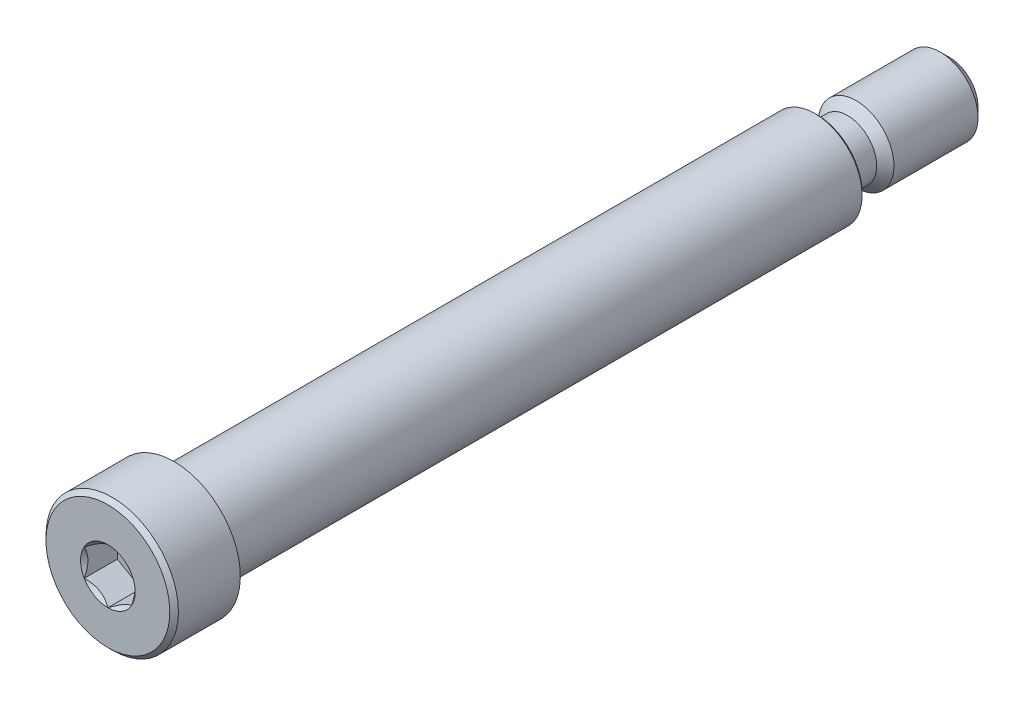
ISO-10303-21;
HEADER;
FILE_DESCRIPTION(('STEP AP214'),'2;1');
FILE_NAME('part.step','',(''),(''),'','','');
FILE_SCHEMA(('AUTOMOTIVE_DESIGN { 1 0 10303 214 1 1 1 1 }'));
ENDSEC;
DATA;
#1=APPLICATION_CONTEXT('core data for automotive mechanical design processes');
#2=APPLICATION_PROTOCOL_DEFINITION('international standard','automotive_design',2000,#1);
#3=PRODUCT_CONTEXT('',#1,'mechanical');
#4=PRODUCT('Part','Part','',(#3));
#5=PRODUCT_RELATED_PRODUCT_CATEGORY('part','',(#4));
#6=PRODUCT_DEFINITION_FORMATION('','',#4);
#7=PRODUCT_DEFINITION_CONTEXT('part definition',#1,'design');
#8=PRODUCT_DEFINITION('design','',#6,#7);
#9=PRODUCT_DEFINITION_SHAPE('','',#8);
#10=(LENGTH_UNIT() NAMED_UNIT(*) SI_UNIT(.MILLI.,.METRE.));
#11=(NAMED_UNIT(*) PLANE_ANGLE_UNIT() SI_UNIT($,.RADIAN.));
#12=(NAMED_UNIT(*) SI_UNIT($,.STERADIAN.) SOLID_ANGLE_UNIT());
#13=UNCERTAINTY_MEASURE_WITH_UNIT(LENGTH_MEASURE(1.E-05),#10,'distance_accuracy_value','');
#14=(GEOMETRIC_REPRESENTATION_CONTEXT(3) GLOBAL_UNCERTAINTY_ASSIGNED_CONTEXT((#13)) GLOBAL_UNIT_ASSIGNED_CONTEXT((#10,
#11,#12)) REPRESENTATION_CONTEXT('',''));
#15=CARTESIAN_POINT('',(0.,0.,0.));
#16=DIRECTION('',(0.,0.,1.));
#17=DIRECTION('',(1.,0.,0.));
#18=AXIS2_PLACEMENT_3D('',#15,#16,#17);
#19=CARTESIAN_POINT('',(0.,0.,0.));
#20=DIRECTION('',(0.,0.,1.));
#21=DIRECTION('',(0.,-1.,0.));
#22=AXIS2_PLACEMENT_3D('',#19,#20,#21);
#23=PLANE('',#22);
#24=CARTESIAN_POINT('',(0.,0.,0.));
#25=DIRECTION('',(0.,0.,1.));
#26=DIRECTION('',(1.,0.,0.));
#27=AXIS2_PLACEMENT_3D('',#24,#25,#26);
#28=CIRCLE('',#27,2.29135888084632);
#29=CARTESIAN_POINT('',(0.,-2.29135888084633,0.));
#30=VERTEX_POINT('',#29);
#31=CARTESIAN_POINT('',(1.98437499999999,-1.14567944042318,0.));
#32=VERTEX_POINT('',#31);
#33=EDGE_CURVE('E62',#30,#32,#28,.T.);
#34=ORIENTED_EDGE('',*,*,#33,.F.);
#35=CARTESIAN_POINT('',(-1.984375,-1.14567944042317,0.));
#36=VERTEX_POINT('',#35);
#37=EDGE_CURVE('E69',#36,#30,#28,.T.);
#38=ORIENTED_EDGE('',*,*,#37,.F.);
#39=CARTESIAN_POINT('',(-1.984375,1.14567944042316,0.));
#40=VERTEX_POINT('',#39);
#41=EDGE_CURVE('E148',#40,#36,#28,.T.);
#42=ORIENTED_EDGE('',*,*,#41,.F.);
#43=CARTESIAN_POINT('',(0.,2.29135888084632,0.));
#44=VERTEX_POINT('',#43);
#45=EDGE_CURVE('E140',#44,#40,#28,.T.);
#46=ORIENTED_EDGE('',*,*,#45,.F.);
#47=CARTESIAN_POINT('',(1.984375,1.14567944042316,0.));
#48=VERTEX_POINT('',#47);
#49=EDGE_CURVE('E111',#48,#44,#28,.T.);
#50=ORIENTED_EDGE('',*,*,#49,.F.);
#51=EDGE_CURVE('E101',#32,#48,#28,.T.);
#52=ORIENTED_EDGE('',*,*,#51,.F.);
#53=EDGE_LOOP('',(#34,#38,#42,#46,#50,#52));
#54=FACE_BOUND('',#53,.T.);
#55=CARTESIAN_POINT('',(0.,0.,0.));
#56=DIRECTION('',(0.,0.,1.));
#57=DIRECTION('',(0.,-1.,0.));
#58=AXIS2_PLACEMENT_3D('',#55,#56,#57);
#59=CIRCLE('',#58,5.19509374999999);
#60=CARTESIAN_POINT('',(0.,-5.19509374999999,0.));
#61=VERTEX_POINT('',#60);
#62=EDGE_CURVE('E234',#61,#61,#59,.T.);
#63=ORIENTED_EDGE('',*,*,#62,.T.);
#64=EDGE_LOOP('',(#63));
#65=FACE_BOUND('',#64,.T.);
#66=ADVANCED_FACE('F41',(#54,#65),#23,.T.);
#67=CARTESIAN_POINT('',(0.,0.,-70.64375));
#68=DIRECTION('',(0.,0.,-1.));
#69=DIRECTION('',(0.,1.,0.));
#70=AXIS2_PLACEMENT_3D('',#67,#68,#69);
#71=CYLINDRICAL_SURFACE('',#70,5.55625);
#72=CARTESIAN_POINT('',(0.,0.,-0.361156249999994));
#73=DIRECTION('',(0.,0.,1.));
#74=DIRECTION('',(0.,-1.,0.));
#75=AXIS2_PLACEMENT_3D('',#72,#73,#74);
#76=CIRCLE('',#75,5.55625);
#77=CARTESIAN_POINT('',(0.,-5.55625,-0.361156249999993));
#78=VERTEX_POINT('',#77);
#79=EDGE_CURVE('E237',#78,#78,#76,.F.);
#80=ORIENTED_EDGE('',*,*,#79,.T.);
#81=EDGE_LOOP('',(#80));
#82=FACE_BOUND('',#81,.T.);
#83=CARTESIAN_POINT('',(0.,0.,-5.55625));
#84=DIRECTION('',(0.,0.,-1.));
#85=DIRECTION('',(0.,1.,0.));
#86=AXIS2_PLACEMENT_3D('',#83,#84,#85);
#87=CIRCLE('',#86,5.55625);
#88=CARTESIAN_POINT('',(0.,5.55624999999999,-5.55625));
#89=VERTEX_POINT('',#88);
#90=EDGE_CURVE('E287',#89,#89,#87,.T.);
#91=ORIENTED_EDGE('',*,*,#90,.F.);
#92=EDGE_LOOP('',(#91));
#93=FACE_BOUND('',#92,.T.);
#94=ADVANCED_FACE('F210',(#82,#93),#71,.T.);
#95=CARTESIAN_POINT('',(0.,-5.55625,-5.55625));
#96=DIRECTION('',(0.,0.,-1.));
#97=DIRECTION('',(0.,1.,0.));
#98=AXIS2_PLACEMENT_3D('',#95,#96,#97);
#99=PLANE('',#98);
#100=ORIENTED_EDGE('',*,*,#90,.T.);
#101=EDGE_LOOP('',(#100));
#102=FACE_BOUND('',#101,.T.);
#103=CARTESIAN_POINT('',(0.,0.,-5.55625));
#104=DIRECTION('',(0.,0.,-1.));
#105=DIRECTION('',(0.,1.,0.));
#106=AXIS2_PLACEMENT_3D('',#103,#104,#105);
#107=CIRCLE('',#106,3.96874999999998);
#108=CARTESIAN_POINT('',(0.,3.96874999999998,-5.55625));
#109=VERTEX_POINT('',#108);
#110=EDGE_CURVE('E277',#109,#109,#107,.T.);
#111=ORIENTED_EDGE('',*,*,#110,.F.);
#112=EDGE_LOOP('',(#111));
#113=FACE_BOUND('',#112,.T.);
#114=ADVANCED_FACE('F215',(#102,#113),#99,.T.);
#115=CARTESIAN_POINT('',(0.,0.,-70.64375));
#116=DIRECTION('',(0.,0.,-1.));
#117=DIRECTION('',(0.,1.,0.));
#118=AXIS2_PLACEMENT_3D('',#115,#116,#117);
#119=CYLINDRICAL_SURFACE('',#118,3.96874999999999);
#120=CARTESIAN_POINT('',(0.,0.,-59.32805));
#121=DIRECTION('',(0.,0.,-1.));
#122=DIRECTION('',(0.,1.,0.));
#123=AXIS2_PLACEMENT_3D('',#120,#121,#122);
#124=CIRCLE('',#123,3.96874999999999);
#125=CARTESIAN_POINT('',(0.,3.96874999999997,-59.32805));
#126=VERTEX_POINT('',#125);
#127=EDGE_CURVE('E56',#126,#126,#124,.F.);
#128=ORIENTED_EDGE('',*,*,#127,.T.);
#129=EDGE_LOOP('',(#128));
#130=FACE_BOUND('',#129,.T.);
#131=ORIENTED_EDGE('',*,*,#110,.T.);
#132=EDGE_LOOP('',(#131));
#133=FACE_BOUND('',#132,.T.);
#134=ADVANCED_FACE('F256',(#130,#133),#119,.T.);
#135=CARTESIAN_POINT('',(0.,-3.96875000000001,-59.53125));
#136=DIRECTION('',(0.,0.,-1.));
#137=DIRECTION('',(0.,1.,0.));
#138=AXIS2_PLACEMENT_3D('',#135,#136,#137);
#139=PLANE('',#138);
#140=CARTESIAN_POINT('',(0.,0.,-59.53125));
#141=DIRECTION('',(0.,0.,-1.));
#142=DIRECTION('',(0.,1.,0.));
#143=AXIS2_PLACEMENT_3D('',#140,#141,#142);
#144=CIRCLE('',#143,3.76554999999999);
#145=CARTESIAN_POINT('',(0.,3.76554999999998,-59.53125));
#146=VERTEX_POINT('',#145);
#147=EDGE_CURVE('E243',#146,#146,#144,.T.);
#148=ORIENTED_EDGE('',*,*,#147,.T.);
#149=EDGE_LOOP('',(#148));
#150=FACE_BOUND('',#149,.T.);
#151=CARTESIAN_POINT('',(0.,0.,-59.53125));
#152=DIRECTION('',(0.,0.,-1.));
#153=DIRECTION('',(0.,1.,0.));
#154=AXIS2_PLACEMENT_3D('',#151,#152,#153);
#155=CIRCLE('',#154,3.17500000000004);
#156=CARTESIAN_POINT('',(0.,3.17500000000003,-59.53125));
#157=VERTEX_POINT('',#156);
#158=EDGE_CURVE('E268',#157,#157,#155,.T.);
#159=ORIENTED_EDGE('',*,*,#158,.F.);
#160=EDGE_LOOP('',(#159));
#161=FACE_BOUND('',#160,.T.);
#162=ADVANCED_FACE('F261',(#150,#161),#139,.T.);
#163=CARTESIAN_POINT('',(0.,0.,-60.2551500000001));
#164=DIRECTION('',(0.,0.,-1.));
#165=DIRECTION('',(0.,1.,0.));
#166=AXIS2_PLACEMENT_3D('',#163,#164,#165);
#167=TOROIDAL_SURFACE('',#166,3.17500000000004,0.72390000000005);
#168=CARTESIAN_POINT('',(0.,0.,-60.2551500000001));
#169=DIRECTION('',(0.,0.,-1.));
#170=DIRECTION('',(0.,1.,0.));
#171=AXIS2_PLACEMENT_3D('',#168,#169,#170);
#172=CIRCLE('',#171,2.45109999999999);
#173=CARTESIAN_POINT('',(0.,2.45109999999998,-60.2551500000001));
#174=VERTEX_POINT('',#173);
#175=EDGE_CURVE('E272',#174,#174,#172,.T.);
#176=ORIENTED_EDGE('',*,*,#175,.F.);
#177=EDGE_LOOP('',(#176));
#178=FACE_BOUND('',#177,.T.);
#179=ORIENTED_EDGE('',*,*,#158,.T.);
#180=EDGE_LOOP('',(#179));
#181=FACE_BOUND('',#180,.T.);
#182=ADVANCED_FACE('F264',(#178,#181),#167,.F.);
#183=CARTESIAN_POINT('',(0.,0.,-70.64375));
#184=DIRECTION('',(0.,0.,-1.));
#185=DIRECTION('',(0.,1.,0.));
#186=AXIS2_PLACEMENT_3D('',#183,#184,#185);
#187=CYLINDRICAL_SURFACE('',#186,2.4511);
#188=CARTESIAN_POINT('',(0.,0.,-62.07125));
#189=DIRECTION('',(0.,0.,-1.));
#190=DIRECTION('',(0.,1.,0.));
#191=AXIS2_PLACEMENT_3D('',#188,#189,#190);
#192=CIRCLE('',#191,2.4511);
#193=CARTESIAN_POINT('',(0.,2.45109999999998,-62.07125));
#194=VERTEX_POINT('',#193);
#195=EDGE_CURVE('E280',#194,#194,#192,.T.);
#196=ORIENTED_EDGE('',*,*,#195,.F.);
#197=EDGE_LOOP('',(#196));
#198=FACE_BOUND('',#197,.T.);
#199=ORIENTED_EDGE('',*,*,#175,.T.);
#200=EDGE_LOOP('',(#199));
#201=FACE_BOUND('',#200,.T.);
#202=ADVANCED_FACE('F305',(#198,#201),#187,.T.);
#203=CARTESIAN_POINT('',(0.,0.,-62.07125));
#204=DIRECTION('',(0.,0.,-1.));
#205=DIRECTION('',(0.,1.,0.));
#206=AXIS2_PLACEMENT_3D('',#203,#204,#205);
#207=CONICAL_SURFACE('',#206,2.4511,0.78539816339744);
#208=CARTESIAN_POINT('',(0.,0.,-62.7951500000001));
#209=DIRECTION('',(0.,0.,-1.));
#210=DIRECTION('',(0.,1.,0.));
#211=AXIS2_PLACEMENT_3D('',#208,#209,#210);
#212=CIRCLE('',#211,3.17500000000004);
#213=CARTESIAN_POINT('',(0.,3.17500000000003,-62.7951500000001));
#214=VERTEX_POINT('',#213);
#215=EDGE_CURVE('E271',#214,#214,#212,.F.);
#216=ORIENTED_EDGE('',*,*,#215,.T.);
#217=EDGE_LOOP('',(#216));
#218=FACE_BOUND('',#217,.T.);
#219=ORIENTED_EDGE('',*,*,#195,.T.);
#220=EDGE_LOOP('',(#219));
#221=FACE_BOUND('',#220,.T.);
#222=ADVANCED_FACE('F297',(#218,#221),#207,.T.);
#223=CARTESIAN_POINT('',(0.,-3.17500000000006,-70.64375));
#224=DIRECTION('',(0.,0.,-1.));
#225=DIRECTION('',(0.,1.,0.));
#226=AXIS2_PLACEMENT_3D('',#223,#224,#225);
#227=PLANE('',#226);
#228=CARTESIAN_POINT('',(0.,0.,-70.64375));
#229=DIRECTION('',(0.,0.,-1.));
#230=DIRECTION('',(0.,1.,0.));
#231=AXIS2_PLACEMENT_3D('',#228,#229,#230);
#232=CIRCLE('',#231,2.38125000000004);
#233=CARTESIAN_POINT('',(0.,2.38125000000003,-70.64375));
#234=VERTEX_POINT('',#233);
#235=EDGE_CURVE('E246',#234,#234,#232,.T.);
#236=ORIENTED_EDGE('',*,*,#235,.T.);
#237=EDGE_LOOP('',(#236));
#238=FACE_BOUND('',#237,.T.);
#239=ADVANCED_FACE('F294',(#238),#227,.T.);
#240=CARTESIAN_POINT('',(0.,0.,-70.64375));
#241=DIRECTION('',(0.,0.,-1.));
#242=DIRECTION('',(0.,1.,0.));
#243=AXIS2_PLACEMENT_3D('',#240,#241,#242);
#244=CYLINDRICAL_SURFACE('',#243,3.17500000000004);
#245=CARTESIAN_POINT('',(0.,0.,-69.85));
#246=DIRECTION('',(0.,0.,-1.));
#247=DIRECTION('',(0.,1.,0.));
#248=AXIS2_PLACEMENT_3D('',#245,#246,#247);
#249=CIRCLE('',#248,3.17500000000004);
#250=CARTESIAN_POINT('',(0.,3.17500000000003,-69.85));
#251=VERTEX_POINT('',#250);
#252=EDGE_CURVE('E239',#251,#251,#249,.F.);
#253=ORIENTED_EDGE('',*,*,#252,.T.);
#254=EDGE_LOOP('',(#253));
#255=FACE_BOUND('',#254,.T.);
#256=ORIENTED_EDGE('',*,*,#215,.F.);
#257=EDGE_LOOP('',(#256));
#258=FACE_BOUND('',#257,.T.);
#259=ADVANCED_FACE('F223',(#255,#258),#244,.T.);
#260=CARTESIAN_POINT('',(0.,0.,-70.64375));
#261=DIRECTION('',(0.,0.,1.));
#262=DIRECTION('',(0.,-1.,0.));
#263=AXIS2_PLACEMENT_3D('',#260,#261,#262);
#264=CONICAL_SURFACE('',#263,2.38125000000004,0.785398163397441);
#265=ORIENTED_EDGE('',*,*,#252,.F.);
#266=EDGE_LOOP('',(#265));
#267=FACE_BOUND('',#266,.T.);
#268=ORIENTED_EDGE('',*,*,#235,.F.);
#269=EDGE_LOOP('',(#268));
#270=FACE_BOUND('',#269,.T.);
#271=ADVANCED_FACE('F220',(#267,#270),#264,.T.);
#272=CARTESIAN_POINT('',(0.,0.,-0.361156249999994));
#273=DIRECTION('',(0.,0.,-1.));
#274=DIRECTION('',(0.,1.,0.));
#275=AXIS2_PLACEMENT_3D('',#272,#273,#274);
#276=CONICAL_SURFACE('',#275,5.55625,0.785398163397464);
#277=ORIENTED_EDGE('',*,*,#62,.F.);
#278=EDGE_LOOP('',(#277));
#279=FACE_BOUND('',#278,.T.);
#280=ORIENTED_EDGE('',*,*,#79,.F.);
#281=EDGE_LOOP('',(#280));
#282=FACE_BOUND('',#281,.T.);
#283=ADVANCED_FACE('F222',(#279,#282),#276,.T.);
#284=CARTESIAN_POINT('',(0.,0.,-59.53125));
#285=DIRECTION('',(0.,0.,1.));
#286=DIRECTION('',(0.,-1.,0.));
#287=AXIS2_PLACEMENT_3D('',#284,#285,#286);
#288=CONICAL_SURFACE('',#287,3.76554999999999,0.78539816339745);
#289=ORIENTED_EDGE('',*,*,#127,.F.);
#290=EDGE_LOOP('',(#289));
#291=FACE_BOUND('',#290,.T.);
#292=ORIENTED_EDGE('',*,*,#147,.F.);
#293=EDGE_LOOP('',(#292));
#294=FACE_BOUND('',#293,.T.);
#295=ADVANCED_FACE('F43',(#291,#294),#288,.T.);
#296=CARTESIAN_POINT('',(0.,0.,0.));
#297=DIRECTION('',(0.,0.,1.));
#298=DIRECTION('',(1.,0.,0.));
#299=AXIS2_PLACEMENT_3D('',#296,#297,#298);
#300=CONICAL_SURFACE('',#299,2.29135888084632,0.78539816339745);
#301=ORIENTED_EDGE('',*,*,#49,.T.);
#302=CARTESIAN_POINT('',(1.984575,1.14556397036932,0.00011547878184468));
#303=CARTESIAN_POINT('',(1.9163590048332,1.18494849354191,-0.0392371477360841));
#304=CARTESIAN_POINT('',(1.84700231489304,1.22499159714897,-0.0762786895538144));
#305=CARTESIAN_POINT('',(1.70557619954781,1.30664400291397,-0.144101141576676));
#306=CARTESIAN_POINT('',(1.63349332126322,1.34826107209555,-0.174844310908246));
#307=CARTESIAN_POINT('',(1.488141602734,1.43217992591557,-0.227508111188787));
#308=CARTESIAN_POINT('',(1.41490978751306,1.47446033414662,-0.249561124120036));
#309=CARTESIAN_POINT('',(1.26683381740529,1.55995203534886,-0.283538507056125));
#310=CARTESIAN_POINT('',(1.19199418724657,1.60316071596704,-0.295488243908272));
#311=CARTESIAN_POINT('',(1.06301458545618,1.6776271237807,-0.306269900918095));
#312=CARTESIAN_POINT('',(1.00904128422756,1.7087886237741,-0.307866100940931));
#313=CARTESIAN_POINT('',(0.901182881480198,1.77106070163465,-0.305178161134709));
#314=CARTESIAN_POINT('',(0.847297817514475,1.80217125782056,-0.300891959659542));
#315=CARTESIAN_POINT('',(0.740036461751395,1.86409863044402,-0.286683126986482));
#316=CARTESIAN_POINT('',(0.686660807239859,1.89491507894443,-0.276754189547728));
#317=CARTESIAN_POINT('',(0.580832482591103,1.95601509066827,-0.251804915725463));
#318=CARTESIAN_POINT('',(0.528379742028898,1.98629869455159,-0.236784969610513));
#319=CARTESIAN_POINT('',(0.394017661036351,2.06387267818152,-0.192192148364332));
#320=CARTESIAN_POINT('',(0.312941642841676,2.11068193911104,-0.159257004061668));
#321=CARTESIAN_POINT('',(0.193726693270161,2.17951072233758,-0.103657558797805));
#322=CARTESIAN_POINT('',(0.154440075613999,2.20219286161692,-0.084122407948139));
#323=CARTESIAN_POINT('',(0.0765946381319471,2.24713694590236,-0.0432712618805999));
#324=CARTESIAN_POINT('',(0.0380353888983014,2.26939913882716,-0.0219563604316511));
#325=CARTESIAN_POINT('',(-0.00019999999999975,2.29147435090016,0.000115478781841589));
#326=B_SPLINE_CURVE_WITH_KNOTS('',3,(#302,#303,#304,#305,#306,#307,#308,#309,#310,#311,#312,
#313,#314,#315,#316,#317,#318,#319,#320,#321,#322,#323,#324,#325),.UNSPECIFIED.,.F.,.F.,(4,2,2,
2,2,2,2,2,2,2,2,4),(0.,0.264339630306628,0.530219665093696,0.791876416371464,1.0528742441811,
1.23963984393201,1.42647091743853,1.61351120244035,1.80053715247541,2.09764209964317,
2.24579179873714,2.39385111134157),.UNSPECIFIED.);
#327=EDGE_CURVE('E11',#48,#44,#326,.T.);
#328=ORIENTED_EDGE('',*,*,#327,.F.);
#329=EDGE_LOOP('',(#301,#328));
#330=FACE_BOUND('',#329,.T.);
#331=ADVANCED_FACE('F114',(#330),#300,.F.);
#332=ORIENTED_EDGE('',*,*,#45,.T.);
#333=CARTESIAN_POINT('',(0.000200000000000239,2.29147435090016,0.000115478781841513));
#334=CARTESIAN_POINT('',(-0.0680159951668019,2.25208982772757,-0.0392371477360868));
#335=CARTESIAN_POINT('',(-0.137372685106965,2.21204672412052,-0.0762786895538168));
#336=CARTESIAN_POINT('',(-0.278798800452187,2.13039431835551,-0.144101141576678));
#337=CARTESIAN_POINT('',(-0.350881678736782,2.08877724917393,-0.174844310908248));
#338=CARTESIAN_POINT('',(-0.496233397266003,2.00485839535391,-0.227508111188788));
#339=CARTESIAN_POINT('',(-0.569465212486937,1.96257798712286,-0.249561124120037));
#340=CARTESIAN_POINT('',(-0.717541182594704,1.87708628592063,-0.283538507056125));
#341=CARTESIAN_POINT('',(-0.792380812753422,1.83387760530244,-0.295488243908273));
#342=CARTESIAN_POINT('',(-0.921360414543813,1.75941119748879,-0.306269900918095));
#343=CARTESIAN_POINT('',(-0.97533371577244,1.72824969749539,-0.307866100940931));
#344=CARTESIAN_POINT('',(-1.0831921185198,1.66597761963484,-0.305178161134709));
#345=CARTESIAN_POINT('',(-1.13707718248552,1.63486706344893,-0.300891959659542));
#346=CARTESIAN_POINT('',(-1.2443385382486,1.57293969082547,-0.286683126986482));
#347=CARTESIAN_POINT('',(-1.29771419276014,1.54212324232506,-0.276754189547728));
#348=CARTESIAN_POINT('',(-1.40354251740889,1.48102323060121,-0.251804915725463));
#349=CARTESIAN_POINT('',(-1.4559952579711,1.45073962671789,-0.236784969610513));
#350=CARTESIAN_POINT('',(-1.59035733896365,1.37316564308797,-0.192192148364331));
#351=CARTESIAN_POINT('',(-1.67143335715832,1.32635638215845,-0.159257004061668));
#352=CARTESIAN_POINT('',(-1.79064830672984,1.2575275989319,-0.103657558797804));
#353=CARTESIAN_POINT('',(-1.829934924386,1.23484545965257,-0.0841224079481377));
#354=CARTESIAN_POINT('',(-1.90778036186805,1.18990137536712,-0.043271261880598));
#355=CARTESIAN_POINT('',(-1.9463396111017,1.16763918244233,-0.0219563604316491));
#356=CARTESIAN_POINT('',(-1.984575,1.14556397036932,0.000115478781843431));
#357=B_SPLINE_CURVE_WITH_KNOTS('',3,(#333,#334,#335,#336,#337,#338,#339,#340,#341,#342,#343,
#344,#345,#346,#347,#348,#349,#350,#351,#352,#353,#354,#355,#356),.UNSPECIFIED.,.F.,.F.,(4,2,2,
2,2,2,2,2,2,2,2,4),(0.,0.264339630306626,0.530219665093693,0.791876416371458,1.05287424418109,
1.239639843932,1.42647091743852,1.61351120244034,1.8005371524754,2.09764209964316,
2.24579179873714,2.39385111134157),.UNSPECIFIED.);
#358=EDGE_CURVE('E142',#44,#40,#357,.T.);
#359=ORIENTED_EDGE('',*,*,#358,.F.);
#360=EDGE_LOOP('',(#332,#359));
#361=FACE_BOUND('',#360,.T.);
#362=ADVANCED_FACE('F425',(#361),#300,.F.);
#363=ORIENTED_EDGE('',*,*,#41,.T.);
#364=CARTESIAN_POINT('',(-1.984375,-2.28495242157823,0.734984078816578));
#365=CARTESIAN_POINT('',(-1.984375,-2.22931635455403,0.692986685550772));
#366=CARTESIAN_POINT('',(-1.984375,-2.1733687654839,0.651396054076346));
#367=CARTESIAN_POINT('',(-1.984375,-2.06072770258172,0.569208461471488));
#368=CARTESIAN_POINT('',(-1.984375,-2.00403404503436,0.528611752405051));
#369=CARTESIAN_POINT('',(-1.984375,-1.88936329173489,0.448303503174677));
#370=CARTESIAN_POINT('',(-1.984375,-1.83137965519349,0.408601258813315));
#371=CARTESIAN_POINT('',(-1.984375,-1.71442802137841,0.330685173401299));
#372=CARTESIAN_POINT('',(-1.984375,-1.65546009407228,0.292471227194375));
#373=CARTESIAN_POINT('',(-1.984375,-1.47005472306036,0.176252834013643));
#374=CARTESIAN_POINT('',(-1.984375,-1.34163909427884,0.101347886872387));
#375=CARTESIAN_POINT('',(-1.984375,-1.0784038470548,-0.0356697845602574));
#376=CARTESIAN_POINT('',(-1.984375,-0.943607781407429,-0.0978256335176207));
#377=CARTESIAN_POINT('',(-1.984375,-0.741275100444885,-0.173867421311377));
#378=CARTESIAN_POINT('',(-1.984375,-0.676735408881099,-0.195691938673991));
#379=CARTESIAN_POINT('',(-1.984375,-0.546098118112765,-0.234159536462202));
#380=CARTESIAN_POINT('',(-1.984375,-0.480000411919959,-0.250802259934448));
#381=CARTESIAN_POINT('',(-1.984375,-0.347746170028534,-0.277764619130274));
#382=CARTESIAN_POINT('',(-1.984375,-0.281612071479125,-0.288192590264105));
#383=CARTESIAN_POINT('',(-1.984375,-0.148636620052352,-0.302521852623402));
#384=CARTESIAN_POINT('',(-1.984375,-0.0817953907393256,-0.306424265772612));
#385=CARTESIAN_POINT('',(-1.984375,0.0495156750890627,-0.307412948667325));
#386=CARTESIAN_POINT('',(-1.984375,0.11398377510299,-0.304740821124982));
#387=CARTESIAN_POINT('',(-1.984375,0.242367515846176,-0.293260789502482));
#388=CARTESIAN_POINT('',(-1.984375,0.306283102295919,-0.284452289360783));
#389=CARTESIAN_POINT('',(-1.984375,0.434181040262183,-0.2610309786671));
#390=CARTESIAN_POINT('',(-1.984375,0.498145026858309,-0.246319393767912));
#391=CARTESIAN_POINT('',(-1.984375,0.624675616953007,-0.211873818587871));
#392=CARTESIAN_POINT('',(-1.984375,0.687242336899688,-0.192140248550802));
#393=CARTESIAN_POINT('',(-1.984375,0.884225483826087,-0.122587762769238));
#394=CARTESIAN_POINT('',(-1.984375,1.01583674256468,-0.0648475887435011));
#395=CARTESIAN_POINT('',(-1.984375,1.27288659242652,0.0635303365888));
#396=CARTESIAN_POINT('',(-1.984375,1.3983008827048,0.134214424919414));
#397=CARTESIAN_POINT('',(-1.984375,1.57956687990221,0.2445166638132));
#398=CARTESIAN_POINT('',(-1.984375,1.63738271299424,0.280969829475365));
#399=CARTESIAN_POINT('',(-1.984375,1.75202215386201,0.355415963291706));
#400=CARTESIAN_POINT('',(-1.984375,1.80884568601361,0.393409048078055));
#401=CARTESIAN_POINT('',(-1.984375,1.92116923084255,0.470338808893091));
#402=CARTESIAN_POINT('',(-1.984375,1.97667624512253,0.509265313038792));
#403=CARTESIAN_POINT('',(-1.984375,2.08693170717166,0.588147746121387));
#404=CARTESIAN_POINT('',(-1.984375,2.14168035934792,0.628103389024031));
#405=CARTESIAN_POINT('',(-1.984375,2.19611149046622,0.668480611285427));
#406=B_SPLINE_CURVE_WITH_KNOTS('',3,(#364,#365,#366,#367,#368,#369,#370,#371,#372,#373,#374,
#375,#376,#377,#378,#379,#380,#381,#382,#383,#384,#385,#386,#387,#388,#389,#390,#391,#392,#393,
#394,#395,#396,#397,#398,#399,#400,#401,#402,#403,#404,#405),.UNSPECIFIED.,.F.,.F.,(4,2,2,2,2,2,
2,2,2,2,2,2,2,2,2,2,2,2,2,2,4),(0.,0.209126070008323,0.418304637356571,0.629103979977995,
0.839888401371189,1.28549951116128,1.72957750768352,1.93379389749972,2.13802435186699,
2.33858179514335,2.5391047535064,2.73236963400795,2.92565329006888,3.12231577097489,
3.31896180041346,3.74886295245173,4.18033428125363,4.38536017180291,4.59040161996384,
4.79377749165109,4.99709743524132),.UNSPECIFIED.);
#407=EDGE_CURVE('E146',#40,#36,#406,.F.);
#408=ORIENTED_EDGE('',*,*,#407,.F.);
#409=EDGE_LOOP('',(#363,#408));
#410=FACE_BOUND('',#409,.T.);
#411=ADVANCED_FACE('F432',(#410),#300,.F.);
#412=ORIENTED_EDGE('',*,*,#37,.T.);
#413=CARTESIAN_POINT('',(-1.984575,-1.14556397036933,0.000115478781848584));
#414=CARTESIAN_POINT('',(-1.9163590048332,-1.18494849354192,-0.0392371477360797));
#415=CARTESIAN_POINT('',(-1.84700231489303,-1.22499159714898,-0.0762786895538096));
#416=CARTESIAN_POINT('',(-1.70557619954781,-1.30664400291398,-0.144101141576671));
#417=CARTESIAN_POINT('',(-1.63349332126322,-1.34826107209556,-0.17484431090824));
#418=CARTESIAN_POINT('',(-1.488141602734,-1.43217992591558,-0.22750811118878));
#419=CARTESIAN_POINT('',(-1.41490978751306,-1.47446033414663,-0.249561124120029));
#420=CARTESIAN_POINT('',(-1.2668338174053,-1.55995203534887,-0.283538507056117));
#421=CARTESIAN_POINT('',(-1.19199418724658,-1.60316071596705,-0.295488243908265));
#422=CARTESIAN_POINT('',(-1.06301458545619,-1.67762712378071,-0.306269900918087));
#423=CARTESIAN_POINT('',(-1.00904128422756,-1.70878862377411,-0.307866100940923));
#424=CARTESIAN_POINT('',(-0.9011828814802,-1.77106070163466,-0.3051781611347));
#425=CARTESIAN_POINT('',(-0.847297817514477,-1.80217125782057,-0.300891959659533));
#426=CARTESIAN_POINT('',(-0.740036461751396,-1.86409863044403,-0.286683126986474));
#427=CARTESIAN_POINT('',(-0.68666080723986,-1.89491507894443,-0.27675418954772));
#428=CARTESIAN_POINT('',(-0.580832482591103,-1.95601509066828,-0.251804915725454));
#429=CARTESIAN_POINT('',(-0.528379742028898,-1.9862986945516,-0.236784969610504));
#430=CARTESIAN_POINT('',(-0.39401766103635,-2.06387267818153,-0.192192148364322));
#431=CARTESIAN_POINT('',(-0.312941642841674,-2.11068193911105,-0.159257004061659));
#432=CARTESIAN_POINT('',(-0.193726693270157,-2.17951072233759,-0.103657558797794));
#433=CARTESIAN_POINT('',(-0.154440075613995,-2.20219286161693,-0.0841224079481281));
#434=CARTESIAN_POINT('',(-0.0765946381319425,-2.24713694590237,-0.0432712618805884));
#435=CARTESIAN_POINT('',(-0.0380353888982962,-2.26939913882717,-0.0219563604316392));
#436=CARTESIAN_POINT('',(0.000200000000005316,-2.29147435090017,0.000115478781853732));
#437=B_SPLINE_CURVE_WITH_KNOTS('',3,(#413,#414,#415,#416,#417,#418,#419,#420,#421,#422,#423,
#424,#425,#426,#427,#428,#429,#430,#431,#432,#433,#434,#435,#436),.UNSPECIFIED.,.F.,.F.,(4,2,2,
2,2,2,2,2,2,2,2,4),(0.,0.264339630306626,0.530219665093693,0.791876416371459,1.05287424418109,
1.239639843932,1.42647091743852,1.61351120244035,1.8005371524754,2.09764209964317,
2.24579179873714,2.39385111134158),.UNSPECIFIED.);
#438=EDGE_CURVE('E174',#36,#30,#437,.T.);
#439=ORIENTED_EDGE('',*,*,#438,.F.);
#440=EDGE_LOOP('',(#412,#439));
#441=FACE_BOUND('',#440,.T.);
#442=ADVANCED_FACE('F440',(#441),#300,.F.);
#443=ORIENTED_EDGE('',*,*,#33,.T.);
#444=CARTESIAN_POINT('',(-0.000199999999994455,-2.29147435090017,0.000115478781853656));
#445=CARTESIAN_POINT('',(0.0680159951668081,-2.25208982772758,-0.0392371477360743));
#446=CARTESIAN_POINT('',(0.137372685106972,-2.21204672412053,-0.0762786895538042));
#447=CARTESIAN_POINT('',(0.278798800452193,-2.13039431835552,-0.144101141576666));
#448=CARTESIAN_POINT('',(0.350881678736788,-2.08877724917395,-0.174844310908235));
#449=CARTESIAN_POINT('',(0.49623339726601,-2.00485839535393,-0.227508111188775));
#450=CARTESIAN_POINT('',(0.569465212486944,-1.96257798712287,-0.249561124120024));
#451=CARTESIAN_POINT('',(0.717541182594712,-1.87708628592064,-0.283538507056112));
#452=CARTESIAN_POINT('',(0.79238081275343,-1.83387760530245,-0.29548824390826));
#453=CARTESIAN_POINT('',(0.921360414543821,-1.7594111974888,-0.306269900918082));
#454=CARTESIAN_POINT('',(0.975333715772448,-1.7282496974954,-0.307866100940918));
#455=CARTESIAN_POINT('',(1.08319211851981,-1.66597761963485,-0.305178161134695));
#456=CARTESIAN_POINT('',(1.13707718248553,-1.63486706344894,-0.300891959659529));
#457=CARTESIAN_POINT('',(1.24433853824861,-1.57293969082548,-0.286683126986469));
#458=CARTESIAN_POINT('',(1.29771419276015,-1.54212324232507,-0.276754189547715));
#459=CARTESIAN_POINT('',(1.4035425174089,-1.48102323060122,-0.251804915725449));
#460=CARTESIAN_POINT('',(1.45599525797111,-1.4507396267179,-0.236784969610499));
#461=CARTESIAN_POINT('',(1.59035733896366,-1.37316564308797,-0.192192148364318));
#462=CARTESIAN_POINT('',(1.67143335715833,-1.32635638215846,-0.159257004061655));
#463=CARTESIAN_POINT('',(1.79064830672984,-1.25752759893192,-0.103657558797792));
#464=CARTESIAN_POINT('',(1.82993492438601,-1.23484545965258,-0.0841224079481266));
#465=CARTESIAN_POINT('',(1.90778036186806,-1.18990137536713,-0.0432712618805881));
#466=CARTESIAN_POINT('',(1.9463396111017,-1.16763918244234,-0.0219563604316396));
#467=CARTESIAN_POINT('',(1.984575,-1.14556397036934,0.000115478781852426));
#468=B_SPLINE_CURVE_WITH_KNOTS('',3,(#444,#445,#446,#447,#448,#449,#450,#451,#452,#453,#454,
#455,#456,#457,#458,#459,#460,#461,#462,#463,#464,#465,#466,#467),.UNSPECIFIED.,.F.,.F.,(4,2,2,
2,2,2,2,2,2,2,2,4),(0.,0.264339630306627,0.530219665093694,0.79187641637146,1.05287424418109,
1.239639843932,1.42647091743852,1.61351120244035,1.80053715247541,2.09764209964316,
2.24579179873713,2.39385111134157),.UNSPECIFIED.);
#469=EDGE_CURVE('E127',#30,#32,#468,.T.);
#470=ORIENTED_EDGE('',*,*,#469,.F.);
#471=EDGE_LOOP('',(#443,#470));
#472=FACE_BOUND('',#471,.T.);
#473=ADVANCED_FACE('F167',(#472),#300,.F.);
#474=ORIENTED_EDGE('',*,*,#51,.T.);
#475=CARTESIAN_POINT('',(1.984375,-2.28495242157824,0.734984078816583));
#476=CARTESIAN_POINT('',(1.984375,-2.22931635455403,0.692986685550777));
#477=CARTESIAN_POINT('',(1.984375,-2.17336876548391,0.65139605407635));
#478=CARTESIAN_POINT('',(1.984375,-2.06072770258172,0.569208461471493));
#479=CARTESIAN_POINT('',(1.984375,-2.00403404503436,0.528611752405056));
#480=CARTESIAN_POINT('',(1.984375,-1.8893632917349,0.448303503174682));
#481=CARTESIAN_POINT('',(1.984375,-1.83137965519349,0.40860125881332));
#482=CARTESIAN_POINT('',(1.984375,-1.71442802137841,0.330685173401303));
#483=CARTESIAN_POINT('',(1.984375,-1.65546009407229,0.292471227194379));
#484=CARTESIAN_POINT('',(1.984375,-1.47005472306036,0.176252834013646));
#485=CARTESIAN_POINT('',(1.984375,-1.34163909427884,0.101347886872391));
#486=CARTESIAN_POINT('',(1.984375,-1.07840384705481,-0.0356697845602543));
#487=CARTESIAN_POINT('',(1.984375,-0.943607781407432,-0.0978256335176182));
#488=CARTESIAN_POINT('',(1.984375,-0.741275100444888,-0.173867421311375));
#489=CARTESIAN_POINT('',(1.984375,-0.676735408881101,-0.195691938673989));
#490=CARTESIAN_POINT('',(1.984375,-0.546098118112767,-0.234159536462199));
#491=CARTESIAN_POINT('',(1.984375,-0.48000041191996,-0.250802259934446));
#492=CARTESIAN_POINT('',(1.984375,-0.347746170028536,-0.277764619130272));
#493=CARTESIAN_POINT('',(1.984375,-0.281612071479126,-0.288192590264104));
#494=CARTESIAN_POINT('',(1.984375,-0.148636620052353,-0.3025218526234));
#495=CARTESIAN_POINT('',(1.984375,-0.0817953907393268,-0.30642426577261));
#496=CARTESIAN_POINT('',(1.984375,0.0495156750890617,-0.307412948667323));
#497=CARTESIAN_POINT('',(1.984375,0.113983775102989,-0.304740821124981));
#498=CARTESIAN_POINT('',(1.984375,0.242367515846175,-0.293260789502481));
#499=CARTESIAN_POINT('',(1.984375,0.306283102295918,-0.284452289360782));
#500=CARTESIAN_POINT('',(1.984375,0.434181040262182,-0.261030978667099));
#501=CARTESIAN_POINT('',(1.984375,0.498145026858308,-0.24631939376791));
#502=CARTESIAN_POINT('',(1.984375,0.624675616953006,-0.21187381858787));
#503=CARTESIAN_POINT('',(1.984375,0.687242336899688,-0.192140248550801));
#504=CARTESIAN_POINT('',(1.984375,0.884225483826087,-0.122587762769237));
#505=CARTESIAN_POINT('',(1.984375,1.01583674256468,-0.0648475887434997));
#506=CARTESIAN_POINT('',(1.984375,1.27288659242652,0.0635303365888014));
#507=CARTESIAN_POINT('',(1.984375,1.3983008827048,0.134214424919416));
#508=CARTESIAN_POINT('',(1.984375,1.57956687990221,0.244516663813202));
#509=CARTESIAN_POINT('',(1.984375,1.63738271299424,0.280969829475367));
#510=CARTESIAN_POINT('',(1.984375,1.75202215386202,0.355415963291708));
#511=CARTESIAN_POINT('',(1.984375,1.80884568601361,0.393409048078057));
#512=CARTESIAN_POINT('',(1.984375,1.92116923084255,0.470338808893093));
#513=CARTESIAN_POINT('',(1.984375,1.97667624512253,0.509265313038794));
#514=CARTESIAN_POINT('',(1.984375,2.08693170717166,0.588147746121389));
#515=CARTESIAN_POINT('',(1.984375,2.14168035934792,0.628103389024033));
#516=CARTESIAN_POINT('',(1.984375,2.19611149046622,0.668480611285429));
#517=B_SPLINE_CURVE_WITH_KNOTS('',3,(#475,#476,#477,#478,#479,#480,#481,#482,#483,#484,#485,
#486,#487,#488,#489,#490,#491,#492,#493,#494,#495,#496,#497,#498,#499,#500,#501,#502,#503,#504,
#505,#506,#507,#508,#509,#510,#511,#512,#513,#514,#515,#516),.UNSPECIFIED.,.F.,.F.,(4,2,2,2,2,2,
2,2,2,2,2,2,2,2,2,2,2,2,2,2,4),(0.,0.209126070008323,0.418304637356572,0.629103979977996,
0.83988840137119,1.28549951116128,1.72957750768352,1.93379389749973,2.138024351867,
2.33858179514335,2.53910475350641,2.73236963400796,2.92565329006888,3.12231577097489,
3.31896180041347,3.74886295245174,4.18033428125364,4.38536017180292,4.59040161996384,
4.79377749165109,4.99709743524133),.UNSPECIFIED.);
#518=EDGE_CURVE('E105',#32,#48,#517,.T.);
#519=ORIENTED_EDGE('',*,*,#518,.F.);
#520=EDGE_LOOP('',(#474,#519));
#521=FACE_BOUND('',#520,.T.);
#522=ADVANCED_FACE('F103',(#521),#300,.F.);
#523=CARTESIAN_POINT('',(0.,0.,-2.778125));
#524=DIRECTION('',(0.,0.,1.));
#525=DIRECTION('',(1.,0.,0.));
#526=AXIS2_PLACEMENT_3D('',#523,#524,#525);
#527=PLANE('',#526);
#528=DIRECTION('',(0.,1.,0.));
#529=VECTOR('',#528,1.);
#530=CARTESIAN_POINT('',(1.984375,-1.14567944042317,-2.778125));
#531=LINE('',#530,#529);
#532=CARTESIAN_POINT('',(1.984375,-1.14567944042317,-2.778125));
#533=VERTEX_POINT('',#532);
#534=CARTESIAN_POINT('',(1.984375,1.14567944042316,-2.778125));
#535=VERTEX_POINT('',#534);
#536=EDGE_CURVE('E126',#533,#535,#531,.T.);
#537=ORIENTED_EDGE('',*,*,#536,.T.);
#538=DIRECTION('',(-0.866025403784439,0.5,0.));
#539=VECTOR('',#538,1.);
#540=CARTESIAN_POINT('',(1.984375,1.14567944042316,-2.778125));
#541=LINE('',#540,#539);
#542=CARTESIAN_POINT('',(0.,2.29135888084632,-2.778125));
#543=VERTEX_POINT('',#542);
#544=EDGE_CURVE('E131',#535,#543,#541,.T.);
#545=ORIENTED_EDGE('',*,*,#544,.T.);
#546=DIRECTION('',(-0.866025403784439,-0.5,0.));
#547=VECTOR('',#546,1.);
#548=CARTESIAN_POINT('',(0.,2.29135888084632,-2.778125));
#549=LINE('',#548,#547);
#550=CARTESIAN_POINT('',(-1.984375,1.14567944042316,-2.778125));
#551=VERTEX_POINT('',#550);
#552=EDGE_CURVE('E508',#543,#551,#549,.T.);
#553=ORIENTED_EDGE('',*,*,#552,.T.);
#554=DIRECTION('',(0.,-1.,0.));
#555=VECTOR('',#554,1.);
#556=CARTESIAN_POINT('',(-1.984375,1.14567944042316,-2.778125));
#557=LINE('',#556,#555);
#558=CARTESIAN_POINT('',(-1.984375,-1.14567944042317,-2.778125));
#559=VERTEX_POINT('',#558);
#560=EDGE_CURVE('E479',#551,#559,#557,.T.);
#561=ORIENTED_EDGE('',*,*,#560,.T.);
#562=DIRECTION('',(0.866025403784439,-0.499999999999999,0.));
#563=VECTOR('',#562,1.);
#564=CARTESIAN_POINT('',(-1.984375,-1.14567944042317,-2.778125));
#565=LINE('',#564,#563);
#566=CARTESIAN_POINT('',(0.,-2.29135888084634,-2.778125));
#567=VERTEX_POINT('',#566);
#568=EDGE_CURVE('E502',#559,#567,#565,.T.);
#569=ORIENTED_EDGE('',*,*,#568,.T.);
#570=DIRECTION('',(0.866025403784439,0.5,0.));
#571=VECTOR('',#570,1.);
#572=CARTESIAN_POINT('',(0.,-2.29135888084634,-2.778125));
#573=LINE('',#572,#571);
#574=EDGE_CURVE('E135',#567,#533,#573,.T.);
#575=ORIENTED_EDGE('',*,*,#574,.T.);
#576=EDGE_LOOP('',(#537,#545,#553,#561,#569,#575));
#577=FACE_BOUND('',#576,.T.);
#578=ADVANCED_FACE('F166',(#577),#527,.T.);
#579=CARTESIAN_POINT('',(1.984375,1.14567944042316,-2.778125));
#580=DIRECTION('',(0.5,0.866025403784439,0.));
#581=DIRECTION('',(-0.866025403784439,0.5,0.));
#582=AXIS2_PLACEMENT_3D('',#579,#580,#581);
#583=PLANE('',#582);
#584=DIRECTION('',(0.,0.,1.));
#585=VECTOR('',#584,1.);
#586=CARTESIAN_POINT('',(1.984375,1.14567944042316,-2.778125));
#587=LINE('',#586,#585);
#588=EDGE_CURVE('E122',#535,#48,#587,.T.);
#589=ORIENTED_EDGE('',*,*,#588,.T.);
#590=ORIENTED_EDGE('',*,*,#327,.T.);
#591=DIRECTION('',(0.,0.,1.));
#592=VECTOR('',#591,1.);
#593=CARTESIAN_POINT('',(0.,2.29135888084632,-2.778125));
#594=LINE('',#593,#592);
#595=EDGE_CURVE('E134',#543,#44,#594,.T.);
#596=ORIENTED_EDGE('',*,*,#595,.F.);
#597=ORIENTED_EDGE('',*,*,#544,.F.);
#598=EDGE_LOOP('',(#589,#590,#596,#597));
#599=FACE_BOUND('',#598,.T.);
#600=ADVANCED_FACE('F129',(#599),#583,.F.);
#601=CARTESIAN_POINT('',(0.,2.29135888084632,-2.778125));
#602=DIRECTION('',(-0.5,0.866025403784439,0.));
#603=DIRECTION('',(-0.866025403784439,-0.5,0.));
#604=AXIS2_PLACEMENT_3D('',#601,#602,#603);
#605=PLANE('',#604);
#606=ORIENTED_EDGE('',*,*,#595,.T.);
#607=ORIENTED_EDGE('',*,*,#358,.T.);
#608=DIRECTION('',(0.,0.,1.));
#609=VECTOR('',#608,1.);
#610=CARTESIAN_POINT('',(-1.984375,1.14567944042316,-2.778125));
#611=LINE('',#610,#609);
#612=EDGE_CURVE('E476',#551,#40,#611,.T.);
#613=ORIENTED_EDGE('',*,*,#612,.F.);
#614=ORIENTED_EDGE('',*,*,#552,.F.);
#615=EDGE_LOOP('',(#606,#607,#613,#614));
#616=FACE_BOUND('',#615,.T.);
#617=ADVANCED_FACE('F161',(#616),#605,.F.);
#618=CARTESIAN_POINT('',(-1.984375,1.14567944042316,-2.778125));
#619=DIRECTION('',(-1.,0.,0.));
#620=DIRECTION('',(0.,0.,1.));
#621=AXIS2_PLACEMENT_3D('',#618,#619,#620);
#622=PLANE('',#621);
#623=ORIENTED_EDGE('',*,*,#612,.T.);
#624=ORIENTED_EDGE('',*,*,#407,.T.);
#625=DIRECTION('',(0.,0.,1.));
#626=VECTOR('',#625,1.);
#627=CARTESIAN_POINT('',(-1.984375,-1.14567944042317,-2.778125));
#628=LINE('',#627,#626);
#629=EDGE_CURVE('E482',#559,#36,#628,.T.);
#630=ORIENTED_EDGE('',*,*,#629,.F.);
#631=ORIENTED_EDGE('',*,*,#560,.F.);
#632=EDGE_LOOP('',(#623,#624,#630,#631));
#633=FACE_BOUND('',#632,.T.);
#634=ADVANCED_FACE('F199',(#633),#622,.F.);
#635=CARTESIAN_POINT('',(-1.984375,-1.14567944042317,-2.778125));
#636=DIRECTION('',(-0.499999999999999,-0.866025403784439,0.));
#637=DIRECTION('',(0.866025403784439,-0.5,0.));
#638=AXIS2_PLACEMENT_3D('',#635,#636,#637);
#639=PLANE('',#638);
#640=ORIENTED_EDGE('',*,*,#629,.T.);
#641=ORIENTED_EDGE('',*,*,#438,.T.);
#642=DIRECTION('',(0.,0.,1.));
#643=VECTOR('',#642,1.);
#644=CARTESIAN_POINT('',(0.,-2.29135888084634,-2.778125));
#645=LINE('',#644,#643);
#646=EDGE_CURVE('E486',#567,#30,#645,.T.);
#647=ORIENTED_EDGE('',*,*,#646,.F.);
#648=ORIENTED_EDGE('',*,*,#568,.F.);
#649=EDGE_LOOP('',(#640,#641,#647,#648));
#650=FACE_BOUND('',#649,.T.);
#651=ADVANCED_FACE('F195',(#650),#639,.F.);
#652=CARTESIAN_POINT('',(0.,-2.29135888084634,-2.778125));
#653=DIRECTION('',(0.5,-0.866025403784438,0.));
#654=DIRECTION('',(0.866025403784439,0.5,0.));
#655=AXIS2_PLACEMENT_3D('',#652,#653,#654);
#656=PLANE('',#655);
#657=ORIENTED_EDGE('',*,*,#646,.T.);
#658=ORIENTED_EDGE('',*,*,#469,.T.);
#659=DIRECTION('',(0.,0.,1.));
#660=VECTOR('',#659,1.);
#661=CARTESIAN_POINT('',(1.984375,-1.14567944042317,-2.778125));
#662=LINE('',#661,#660);
#663=EDGE_CURVE('E124',#533,#32,#662,.T.);
#664=ORIENTED_EDGE('',*,*,#663,.F.);
#665=ORIENTED_EDGE('',*,*,#574,.F.);
#666=EDGE_LOOP('',(#657,#658,#664,#665));
#667=FACE_BOUND('',#666,.T.);
#668=ADVANCED_FACE('F192',(#667),#656,.F.);
#669=CARTESIAN_POINT('',(1.984375,-1.14567944042317,-2.778125));
#670=DIRECTION('',(1.,0.,0.));
#671=DIRECTION('',(0.,0.,-1.));
#672=AXIS2_PLACEMENT_3D('',#669,#670,#671);
#673=PLANE('',#672);
#674=ORIENTED_EDGE('',*,*,#663,.T.);
#675=ORIENTED_EDGE('',*,*,#518,.T.);
#676=ORIENTED_EDGE('',*,*,#588,.F.);
#677=ORIENTED_EDGE('',*,*,#536,.F.);
#678=EDGE_LOOP('',(#674,#675,#676,#677));
#679=FACE_BOUND('',#678,.T.);
#680=ADVANCED_FACE('F120',(#679),#673,.F.);
#681=CLOSED_SHELL('',(#66,#94,#114,#134,#162,#182,#202,#222,#239,#259,#271,#283,#295,#331,#362,
#411,#442,#473,#522,#578,#600,#617,#634,#651,#668,#680));
#682=MANIFOLD_SOLID_BREP('B2',#681);
#683=ADVANCED_BREP_SHAPE_REPRESENTATION('',(#18,#682),#14);
#684=SHAPE_DEFINITION_REPRESENTATION(#9,#683);
ENDSEC;
END-ISO-10303-21;
